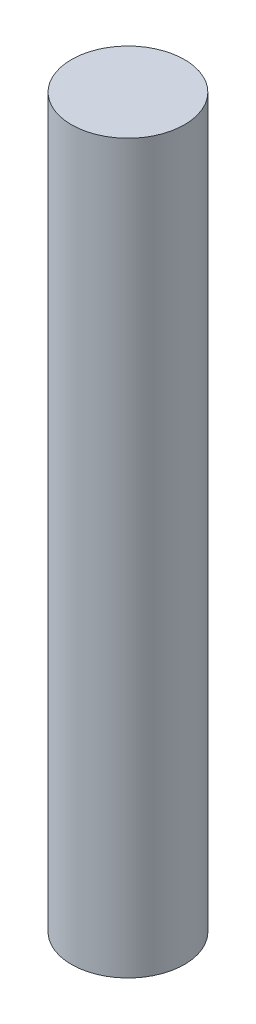
ISO-10303-21;
HEADER;
FILE_DESCRIPTION(('STEP AP214'),'2;1');
FILE_NAME('part.step','',(''),(''),'','','');
FILE_SCHEMA(('AUTOMOTIVE_DESIGN { 1 0 10303 214 1 1 1 1 }'));
ENDSEC;
DATA;
#1=APPLICATION_CONTEXT('core data for automotive mechanical design processes');
#2=APPLICATION_PROTOCOL_DEFINITION('international standard','automotive_design',2000,#1);
#3=PRODUCT_CONTEXT('',#1,'mechanical');
#4=PRODUCT('Part','Part','',(#3));
#5=PRODUCT_RELATED_PRODUCT_CATEGORY('part','',(#4));
#6=PRODUCT_DEFINITION_FORMATION('','',#4);
#7=PRODUCT_DEFINITION_CONTEXT('part definition',#1,'design');
#8=PRODUCT_DEFINITION('design','',#6,#7);
#9=PRODUCT_DEFINITION_SHAPE('','',#8);
#10=(LENGTH_UNIT() NAMED_UNIT(*) SI_UNIT(.MILLI.,.METRE.));
#11=(NAMED_UNIT(*) PLANE_ANGLE_UNIT() SI_UNIT($,.RADIAN.));
#12=(NAMED_UNIT(*) SI_UNIT($,.STERADIAN.) SOLID_ANGLE_UNIT());
#13=UNCERTAINTY_MEASURE_WITH_UNIT(LENGTH_MEASURE(1.E-05),#10,'distance_accuracy_value','');
#14=(GEOMETRIC_REPRESENTATION_CONTEXT(3) GLOBAL_UNCERTAINTY_ASSIGNED_CONTEXT((#13)) GLOBAL_UNIT_ASSIGNED_CONTEXT((#10,
#11,#12)) REPRESENTATION_CONTEXT('',''));
#15=CARTESIAN_POINT('',(0.,0.,0.));
#16=DIRECTION('',(0.,0.,1.));
#17=DIRECTION('',(1.,0.,0.));
#18=AXIS2_PLACEMENT_3D('',#15,#16,#17);
#19=CARTESIAN_POINT('',(0.,469.9,0.));
#20=DIRECTION('',(0.,-1.,0.));
#21=DIRECTION('',(0.,0.,-1.));
#22=AXIS2_PLACEMENT_3D('',#19,#20,#21);
#23=CYLINDRICAL_SURFACE('',#22,36.5125);
#24=CARTESIAN_POINT('',(0.,469.9,0.));
#25=DIRECTION('',(0.,1.,0.));
#26=DIRECTION('',(0.,0.,1.));
#27=AXIS2_PLACEMENT_3D('',#24,#25,#26);
#28=CIRCLE('',#27,36.5125);
#29=CARTESIAN_POINT('',(0.,469.9,36.5125));
#30=VERTEX_POINT('',#29);
#31=EDGE_CURVE('E10',#30,#30,#28,.T.);
#32=ORIENTED_EDGE('',*,*,#31,.F.);
#33=EDGE_LOOP('',(#32));
#34=FACE_BOUND('',#33,.T.);
#35=CARTESIAN_POINT('',(0.,0.,0.));
#36=DIRECTION('',(0.,1.,0.));
#37=DIRECTION('',(0.,0.,1.));
#38=AXIS2_PLACEMENT_3D('',#35,#36,#37);
#39=CIRCLE('',#38,36.5125);
#40=CARTESIAN_POINT('',(0.,0.,36.5125));
#41=VERTEX_POINT('',#40);
#42=EDGE_CURVE('E36',#41,#41,#39,.T.);
#43=ORIENTED_EDGE('',*,*,#42,.T.);
#44=EDGE_LOOP('',(#43));
#45=FACE_BOUND('',#44,.T.);
#46=ADVANCED_FACE('F33',(#34,#45),#23,.T.);
#47=CARTESIAN_POINT('',(0.,469.9,0.));
#48=DIRECTION('',(0.,1.,0.));
#49=DIRECTION('',(0.,0.,1.));
#50=AXIS2_PLACEMENT_3D('',#47,#48,#49);
#51=PLANE('',#50);
#52=ORIENTED_EDGE('',*,*,#31,.T.);
#53=EDGE_LOOP('',(#52));
#54=FACE_BOUND('',#53,.T.);
#55=ADVANCED_FACE('F48',(#54),#51,.T.);
#56=CARTESIAN_POINT('',(0.,0.,0.));
#57=DIRECTION('',(0.,1.,0.));
#58=DIRECTION('',(0.,0.,1.));
#59=AXIS2_PLACEMENT_3D('',#56,#57,#58);
#60=PLANE('',#59);
#61=ORIENTED_EDGE('',*,*,#42,.F.);
#62=EDGE_LOOP('',(#61));
#63=FACE_BOUND('',#62,.T.);
#64=ADVANCED_FACE('F46',(#63),#60,.F.);
#65=CLOSED_SHELL('',(#46,#55,#64));
#66=MANIFOLD_SOLID_BREP('B2',#65);
#67=ADVANCED_BREP_SHAPE_REPRESENTATION('',(#18,#66),#14);
#68=SHAPE_DEFINITION_REPRESENTATION(#9,#67);
ENDSEC;
END-ISO-10303-21;
